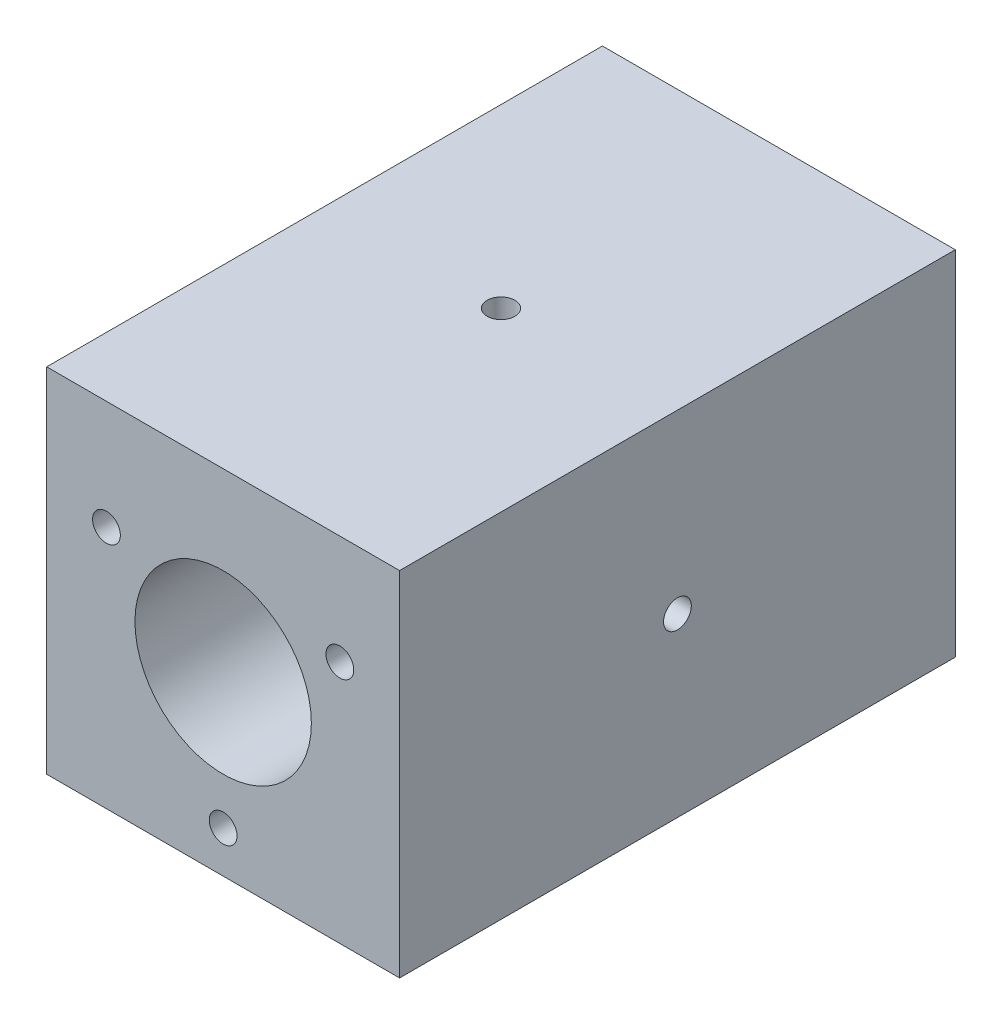
ISO-10303-21;
HEADER;
FILE_DESCRIPTION(('STEP AP214'),'2;1');
FILE_NAME('part.step','',(''),(''),'','','');
FILE_SCHEMA(('AUTOMOTIVE_DESIGN { 1 0 10303 214 1 1 1 1 }'));
ENDSEC;
DATA;
#1=APPLICATION_CONTEXT('core data for automotive mechanical design processes');
#2=APPLICATION_PROTOCOL_DEFINITION('international standard','automotive_design',2000,#1);
#3=PRODUCT_CONTEXT('',#1,'mechanical');
#4=PRODUCT('Part','Part','',(#3));
#5=PRODUCT_RELATED_PRODUCT_CATEGORY('part','',(#4));
#6=PRODUCT_DEFINITION_FORMATION('','',#4);
#7=PRODUCT_DEFINITION_CONTEXT('part definition',#1,'design');
#8=PRODUCT_DEFINITION('design','',#6,#7);
#9=PRODUCT_DEFINITION_SHAPE('','',#8);
#10=(LENGTH_UNIT() NAMED_UNIT(*) SI_UNIT(.MILLI.,.METRE.));
#11=(NAMED_UNIT(*) PLANE_ANGLE_UNIT() SI_UNIT($,.RADIAN.));
#12=(NAMED_UNIT(*) SI_UNIT($,.STERADIAN.) SOLID_ANGLE_UNIT());
#13=UNCERTAINTY_MEASURE_WITH_UNIT(LENGTH_MEASURE(1.E-05),#10,'distance_accuracy_value','');
#14=(GEOMETRIC_REPRESENTATION_CONTEXT(3) GLOBAL_UNCERTAINTY_ASSIGNED_CONTEXT((#13)) GLOBAL_UNIT_ASSIGNED_CONTEXT((#10,
#11,#12)) REPRESENTATION_CONTEXT('',''));
#15=CARTESIAN_POINT('',(0.,0.,0.));
#16=DIRECTION('',(0.,0.,1.));
#17=DIRECTION('',(1.,0.,0.));
#18=AXIS2_PLACEMENT_3D('',#15,#16,#17);
#19=CARTESIAN_POINT('',(0.,0.,25.));
#20=DIRECTION('',(0.,0.,-1.));
#21=DIRECTION('',(-1.,0.,0.));
#22=AXIS2_PLACEMENT_3D('',#19,#20,#21);
#23=PLANE('',#22);
#24=DIRECTION('',(0.,-1.,0.));
#25=VECTOR('',#24,1.);
#26=CARTESIAN_POINT('',(-15.875,15.875,25.));
#27=LINE('',#26,#25);
#28=CARTESIAN_POINT('',(-15.875,15.875,25.));
#29=VERTEX_POINT('',#28);
#30=CARTESIAN_POINT('',(-15.875,-15.875,25.));
#31=VERTEX_POINT('',#30);
#32=EDGE_CURVE('E106',#29,#31,#27,.T.);
#33=ORIENTED_EDGE('',*,*,#32,.T.);
#34=DIRECTION('',(1.,0.,0.));
#35=VECTOR('',#34,1.);
#36=CARTESIAN_POINT('',(15.875,-15.875,25.));
#37=LINE('',#36,#35);
#38=CARTESIAN_POINT('',(15.875,-15.875,25.));
#39=VERTEX_POINT('',#38);
#40=EDGE_CURVE('E101',#31,#39,#37,.T.);
#41=ORIENTED_EDGE('',*,*,#40,.T.);
#42=DIRECTION('',(0.,1.,0.));
#43=VECTOR('',#42,1.);
#44=CARTESIAN_POINT('',(15.875,15.875,25.));
#45=LINE('',#44,#43);
#46=CARTESIAN_POINT('',(15.875,15.875,25.));
#47=VERTEX_POINT('',#46);
#48=EDGE_CURVE('E104',#39,#47,#45,.T.);
#49=ORIENTED_EDGE('',*,*,#48,.T.);
#50=DIRECTION('',(-1.,0.,0.));
#51=VECTOR('',#50,1.);
#52=CARTESIAN_POINT('',(15.875,15.875,25.));
#53=LINE('',#52,#51);
#54=EDGE_CURVE('E71',#47,#29,#53,.T.);
#55=ORIENTED_EDGE('',*,*,#54,.T.);
#56=EDGE_LOOP('',(#33,#41,#49,#55));
#57=FACE_BOUND('',#56,.T.);
#58=CARTESIAN_POINT('',(0.,0.,25.));
#59=DIRECTION('',(0.,0.,1.));
#60=DIRECTION('',(1.,0.,0.));
#61=AXIS2_PLACEMENT_3D('',#58,#59,#60);
#62=CIRCLE('',#61,7.9375);
#63=CARTESIAN_POINT('',(7.93750000000001,0.,25.));
#64=VERTEX_POINT('',#63);
#65=EDGE_CURVE('E126',#64,#64,#62,.T.);
#66=ORIENTED_EDGE('',*,*,#65,.F.);
#67=EDGE_LOOP('',(#66));
#68=FACE_BOUND('',#67,.T.);
#69=CARTESIAN_POINT('',(-10.5,6.06217782649108,25.));
#70=DIRECTION('',(0.,0.,1.));
#71=DIRECTION('',(1.,0.,0.));
#72=AXIS2_PLACEMENT_3D('',#69,#70,#71);
#73=CIRCLE('',#72,1.25);
#74=CARTESIAN_POINT('',(-9.25,6.06217782649108,25.));
#75=VERTEX_POINT('',#74);
#76=EDGE_CURVE('E148',#75,#75,#73,.T.);
#77=ORIENTED_EDGE('',*,*,#76,.F.);
#78=EDGE_LOOP('',(#77));
#79=FACE_BOUND('',#78,.T.);
#80=CARTESIAN_POINT('',(10.5,6.06217782649108,25.));
#81=DIRECTION('',(0.,0.,1.));
#82=DIRECTION('',(1.,0.,0.));
#83=AXIS2_PLACEMENT_3D('',#80,#81,#82);
#84=CIRCLE('',#83,1.25);
#85=CARTESIAN_POINT('',(11.75,6.06217782649108,25.));
#86=VERTEX_POINT('',#85);
#87=EDGE_CURVE('E156',#86,#86,#84,.T.);
#88=ORIENTED_EDGE('',*,*,#87,.F.);
#89=EDGE_LOOP('',(#88));
#90=FACE_BOUND('',#89,.T.);
#91=CARTESIAN_POINT('',(0.,-12.1243556529821,25.));
#92=DIRECTION('',(0.,0.,1.));
#93=DIRECTION('',(1.,0.,0.));
#94=AXIS2_PLACEMENT_3D('',#91,#92,#93);
#95=CIRCLE('',#94,1.25);
#96=CARTESIAN_POINT('',(1.25,-12.1243556529821,25.));
#97=VERTEX_POINT('',#96);
#98=EDGE_CURVE('E164',#97,#97,#95,.T.);
#99=ORIENTED_EDGE('',*,*,#98,.F.);
#100=EDGE_LOOP('',(#99));
#101=FACE_BOUND('',#100,.T.);
#102=ADVANCED_FACE('F53',(#57,#68,#79,#90,#101),#23,.F.);
#103=CARTESIAN_POINT('',(0.,0.,-25.));
#104=DIRECTION('',(0.,0.,-1.));
#105=DIRECTION('',(-1.,0.,0.));
#106=AXIS2_PLACEMENT_3D('',#103,#104,#105);
#107=PLANE('',#106);
#108=CARTESIAN_POINT('',(10.5,6.06217782649108,-25.));
#109=DIRECTION('',(0.,0.,1.));
#110=DIRECTION('',(1.,0.,0.));
#111=AXIS2_PLACEMENT_3D('',#108,#109,#110);
#112=CIRCLE('',#111,1.25);
#113=CARTESIAN_POINT('',(11.75,6.06217782649108,-25.));
#114=VERTEX_POINT('',#113);
#115=EDGE_CURVE('E160',#114,#114,#112,.T.);
#116=ORIENTED_EDGE('',*,*,#115,.T.);
#117=EDGE_LOOP('',(#116));
#118=FACE_BOUND('',#117,.T.);
#119=CARTESIAN_POINT('',(0.,0.,-25.));
#120=DIRECTION('',(0.,0.,1.));
#121=DIRECTION('',(1.,0.,0.));
#122=AXIS2_PLACEMENT_3D('',#119,#120,#121);
#123=CIRCLE('',#122,7.9375);
#124=CARTESIAN_POINT('',(7.93750000000001,0.,-25.));
#125=VERTEX_POINT('',#124);
#126=EDGE_CURVE('E144',#125,#125,#123,.T.);
#127=ORIENTED_EDGE('',*,*,#126,.T.);
#128=EDGE_LOOP('',(#127));
#129=FACE_BOUND('',#128,.T.);
#130=DIRECTION('',(0.,-1.,0.));
#131=VECTOR('',#130,1.);
#132=CARTESIAN_POINT('',(-15.875,15.875,-25.));
#133=LINE('',#132,#131);
#134=CARTESIAN_POINT('',(-15.875,15.875,-25.));
#135=VERTEX_POINT('',#134);
#136=CARTESIAN_POINT('',(-15.875,-15.875,-25.));
#137=VERTEX_POINT('',#136);
#138=EDGE_CURVE('E122',#135,#137,#133,.T.);
#139=ORIENTED_EDGE('',*,*,#138,.F.);
#140=DIRECTION('',(-1.,0.,0.));
#141=VECTOR('',#140,1.);
#142=CARTESIAN_POINT('',(15.875,15.875,-25.));
#143=LINE('',#142,#141);
#144=CARTESIAN_POINT('',(15.875,15.875,-25.));
#145=VERTEX_POINT('',#144);
#146=EDGE_CURVE('E94',#145,#135,#143,.T.);
#147=ORIENTED_EDGE('',*,*,#146,.F.);
#148=DIRECTION('',(0.,1.,0.));
#149=VECTOR('',#148,1.);
#150=CARTESIAN_POINT('',(15.875,15.875,-25.));
#151=LINE('',#150,#149);
#152=CARTESIAN_POINT('',(15.875,-15.875,-25.));
#153=VERTEX_POINT('',#152);
#154=EDGE_CURVE('E88',#153,#145,#151,.T.);
#155=ORIENTED_EDGE('',*,*,#154,.F.);
#156=DIRECTION('',(1.,0.,0.));
#157=VECTOR('',#156,1.);
#158=CARTESIAN_POINT('',(15.875,-15.875,-25.));
#159=LINE('',#158,#157);
#160=EDGE_CURVE('E111',#137,#153,#159,.T.);
#161=ORIENTED_EDGE('',*,*,#160,.F.);
#162=EDGE_LOOP('',(#139,#147,#155,#161));
#163=FACE_BOUND('',#162,.T.);
#164=CARTESIAN_POINT('',(-10.5,6.06217782649108,-25.));
#165=DIRECTION('',(0.,0.,1.));
#166=DIRECTION('',(1.,0.,0.));
#167=AXIS2_PLACEMENT_3D('',#164,#165,#166);
#168=CIRCLE('',#167,1.25);
#169=CARTESIAN_POINT('',(-9.25,6.06217782649108,-25.));
#170=VERTEX_POINT('',#169);
#171=EDGE_CURVE('E152',#170,#170,#168,.T.);
#172=ORIENTED_EDGE('',*,*,#171,.T.);
#173=EDGE_LOOP('',(#172));
#174=FACE_BOUND('',#173,.T.);
#175=CARTESIAN_POINT('',(0.,-12.1243556529821,-25.));
#176=DIRECTION('',(0.,0.,1.));
#177=DIRECTION('',(1.,0.,0.));
#178=AXIS2_PLACEMENT_3D('',#175,#176,#177);
#179=CIRCLE('',#178,1.25);
#180=CARTESIAN_POINT('',(1.25,-12.1243556529821,-25.));
#181=VERTEX_POINT('',#180);
#182=EDGE_CURVE('E168',#181,#181,#179,.T.);
#183=ORIENTED_EDGE('',*,*,#182,.T.);
#184=EDGE_LOOP('',(#183));
#185=FACE_BOUND('',#184,.T.);
#186=ADVANCED_FACE('F139',(#118,#129,#163,#174,#185),#107,.T.);
#187=CARTESIAN_POINT('',(-15.875,15.875,25.));
#188=DIRECTION('',(1.,0.,0.));
#189=DIRECTION('',(0.,1.,0.));
#190=AXIS2_PLACEMENT_3D('',#187,#188,#189);
#191=PLANE('',#190);
#192=ORIENTED_EDGE('',*,*,#138,.T.);
#193=DIRECTION('',(0.,0.,-1.));
#194=VECTOR('',#193,1.);
#195=CARTESIAN_POINT('',(-15.875,-15.875,25.));
#196=LINE('',#195,#194);
#197=EDGE_CURVE('E11',#31,#137,#196,.T.);
#198=ORIENTED_EDGE('',*,*,#197,.F.);
#199=ORIENTED_EDGE('',*,*,#32,.F.);
#200=DIRECTION('',(0.,0.,-1.));
#201=VECTOR('',#200,1.);
#202=CARTESIAN_POINT('',(-15.875,15.875,25.));
#203=LINE('',#202,#201);
#204=EDGE_CURVE('E118',#29,#135,#203,.T.);
#205=ORIENTED_EDGE('',*,*,#204,.T.);
#206=EDGE_LOOP('',(#192,#198,#199,#205));
#207=FACE_BOUND('',#206,.T.);
#208=ADVANCED_FACE('F55',(#207),#191,.F.);
#209=CARTESIAN_POINT('',(15.875,-15.875,25.));
#210=DIRECTION('',(0.,1.,0.));
#211=DIRECTION('',(-1.,0.,0.));
#212=AXIS2_PLACEMENT_3D('',#209,#210,#211);
#213=PLANE('',#212);
#214=ORIENTED_EDGE('',*,*,#160,.T.);
#215=DIRECTION('',(0.,0.,-1.));
#216=VECTOR('',#215,1.);
#217=CARTESIAN_POINT('',(15.875,-15.875,25.));
#218=LINE('',#217,#216);
#219=EDGE_CURVE('E63',#39,#153,#218,.T.);
#220=ORIENTED_EDGE('',*,*,#219,.F.);
#221=ORIENTED_EDGE('',*,*,#40,.F.);
#222=ORIENTED_EDGE('',*,*,#197,.T.);
#223=EDGE_LOOP('',(#214,#220,#221,#222));
#224=FACE_BOUND('',#223,.T.);
#225=ADVANCED_FACE('F110',(#224),#213,.F.);
#226=CARTESIAN_POINT('',(15.875,15.875,25.));
#227=DIRECTION('',(-1.,0.,0.));
#228=DIRECTION('',(0.,-1.,0.));
#229=AXIS2_PLACEMENT_3D('',#226,#227,#228);
#230=PLANE('',#229);
#231=CARTESIAN_POINT('',(15.875,0.,0.));
#232=DIRECTION('',(1.,0.,0.));
#233=DIRECTION('',(0.,0.,-1.));
#234=AXIS2_PLACEMENT_3D('',#231,#232,#233);
#235=CIRCLE('',#234,1.24999999999999);
#236=CARTESIAN_POINT('',(15.875,0.,-1.24999999999999));
#237=VERTEX_POINT('',#236);
#238=EDGE_CURVE('E205',#237,#237,#235,.T.);
#239=ORIENTED_EDGE('',*,*,#238,.F.);
#240=EDGE_LOOP('',(#239));
#241=FACE_BOUND('',#240,.T.);
#242=ORIENTED_EDGE('',*,*,#154,.T.);
#243=DIRECTION('',(0.,0.,-1.));
#244=VECTOR('',#243,1.);
#245=CARTESIAN_POINT('',(15.875,15.875,25.));
#246=LINE('',#245,#244);
#247=EDGE_CURVE('E113',#47,#145,#246,.T.);
#248=ORIENTED_EDGE('',*,*,#247,.F.);
#249=ORIENTED_EDGE('',*,*,#48,.F.);
#250=ORIENTED_EDGE('',*,*,#219,.T.);
#251=EDGE_LOOP('',(#242,#248,#249,#250));
#252=FACE_BOUND('',#251,.T.);
#253=ADVANCED_FACE('F114',(#241,#252),#230,.F.);
#254=CARTESIAN_POINT('',(15.875,15.875,25.));
#255=DIRECTION('',(0.,-1.,0.));
#256=DIRECTION('',(1.,0.,0.));
#257=AXIS2_PLACEMENT_3D('',#254,#255,#256);
#258=PLANE('',#257);
#259=CARTESIAN_POINT('',(0.,15.875,0.));
#260=DIRECTION('',(0.,1.,0.));
#261=DIRECTION('',(0.,0.,1.));
#262=AXIS2_PLACEMENT_3D('',#259,#260,#261);
#263=CIRCLE('',#262,1.25);
#264=CARTESIAN_POINT('',(0.,15.875,1.25));
#265=VERTEX_POINT('',#264);
#266=EDGE_CURVE('E184',#265,#265,#263,.T.);
#267=ORIENTED_EDGE('',*,*,#266,.F.);
#268=EDGE_LOOP('',(#267));
#269=FACE_BOUND('',#268,.T.);
#270=ORIENTED_EDGE('',*,*,#146,.T.);
#271=ORIENTED_EDGE('',*,*,#204,.F.);
#272=ORIENTED_EDGE('',*,*,#54,.F.);
#273=ORIENTED_EDGE('',*,*,#247,.T.);
#274=EDGE_LOOP('',(#270,#271,#272,#273));
#275=FACE_BOUND('',#274,.T.);
#276=ADVANCED_FACE('F136',(#269,#275),#258,.F.);
#277=CARTESIAN_POINT('',(0.,0.,25.));
#278=DIRECTION('',(0.,0.,-1.));
#279=DIRECTION('',(-1.,0.,0.));
#280=AXIS2_PLACEMENT_3D('',#277,#278,#279);
#281=CYLINDRICAL_SURFACE('',#280,7.9375);
#282=CARTESIAN_POINT('',(7.93750000000001,0.,-1.24999999999999));
#283=CARTESIAN_POINT('',(7.93749884526427,-0.0697504150927674,-1.24999715690116));
#284=CARTESIAN_POINT('',(7.93657099739005,-0.139540255432463,-1.24414214042688));
#285=CARTESIAN_POINT('',(7.9329589474276,-0.277166301084599,-1.22088436228467));
#286=CARTESIAN_POINT('',(7.93027307667876,-0.345000586315197,-1.20347062922113));
#287=CARTESIAN_POINT('',(7.92344656155909,-0.476704125127085,-1.15763109928079));
#288=CARTESIAN_POINT('',(7.91930705658603,-0.540576438204386,-1.12921392541241));
#289=CARTESIAN_POINT('',(7.91002969799435,-0.662637137536172,-1.06219591551795));
#290=CARTESIAN_POINT('',(7.90489197232907,-0.720826250836256,-1.02359638445419));
#291=CARTESIAN_POINT('',(7.89413945906247,-0.830376856604447,-0.936956904689493));
#292=CARTESIAN_POINT('',(7.88852131381747,-0.881682542018239,-0.888846800414665));
#293=CARTESIAN_POINT('',(7.8774671865371,-0.975528165248917,-0.784702836989211));
#294=CARTESIAN_POINT('',(7.87203121543035,-1.01806757796236,-0.728668503512718));
#295=CARTESIAN_POINT('',(7.86192437477424,-1.09339319291298,-0.609888015013124));
#296=CARTESIAN_POINT('',(7.85725784468265,-1.12612487509418,-0.547106884300299));
#297=CARTESIAN_POINT('',(7.84926443015854,-1.18055738222958,-0.416852120969527));
#298=CARTESIAN_POINT('',(7.84593746514309,-1.20225887073718,-0.349378770903369));
#299=CARTESIAN_POINT('',(7.84103307296807,-1.23384053416383,-0.21224390385941));
#300=CARTESIAN_POINT('',(7.83944146000214,-1.24381661283797,-0.142604989907457));
#301=CARTESIAN_POINT('',(7.83814498405106,-1.25196148267928,-0.00262482112364988));
#302=CARTESIAN_POINT('',(7.83844000178568,-1.25013102030242,0.0677163890255272));
#303=CARTESIAN_POINT('',(7.8408704904039,-1.23479302959007,0.206423844941958));
#304=CARTESIAN_POINT('',(7.84298906258341,-1.22139271446387,0.274802285082373));
#305=CARTESIAN_POINT('',(7.84880152933236,-1.18346341997124,0.40832798997412));
#306=CARTESIAN_POINT('',(7.85249547261565,-1.15893409647064,0.473475154737981));
#307=CARTESIAN_POINT('',(7.86106095443948,-1.09933280333051,0.599012934343867));
#308=CARTESIAN_POINT('',(7.86593750418005,-1.06421581101909,0.659381817927734));
#309=CARTESIAN_POINT('',(7.87631517667283,-0.984468043254831,0.773410723001881));
#310=CARTESIAN_POINT('',(7.88181634452122,-0.939836580671971,0.82707025950237));
#311=CARTESIAN_POINT('',(7.89289789663712,-0.841740186655551,0.926778309363158));
#312=CARTESIAN_POINT('',(7.89847848488607,-0.78818315923662,0.972736240953957));
#313=CARTESIAN_POINT('',(7.90903379069807,-0.674068754426928,1.05502591003618));
#314=CARTESIAN_POINT('',(7.91400850509368,-0.613511340442199,1.09135759720391));
#315=CARTESIAN_POINT('',(7.92279753342772,-0.48703374878246,1.15336967092633));
#316=CARTESIAN_POINT('',(7.92661103736327,-0.421109868165423,1.17904262699487));
#317=CARTESIAN_POINT('',(7.9326413197818,-0.285812810610449,1.21892741584569));
#318=CARTESIAN_POINT('',(7.93485821736243,-0.216439891363735,1.23314010350756));
#319=CARTESIAN_POINT('',(7.93742962433742,-0.0769953220393042,1.24957943781758));
#320=CARTESIAN_POINT('',(7.93780347008134,-0.00693868750640217,1.25193053627866));
#321=CARTESIAN_POINT('',(7.93669942846577,0.132567999528165,1.24491092364233));
#322=CARTESIAN_POINT('',(7.93522160447956,0.202018072707433,1.2355406137093));
#323=CARTESIAN_POINT('',(7.930592235018,0.337959990056605,1.20544767489133));
#324=CARTESIAN_POINT('',(7.9274496947657,0.404465684077796,1.18478610682746));
#325=CARTESIAN_POINT('',(7.91984198415274,0.533069085734835,1.13276185501904));
#326=CARTESIAN_POINT('',(7.91537674627077,0.595166568138833,1.10139862496167));
#327=CARTESIAN_POINT('',(7.90557144085229,0.713735168663208,1.02857239567006));
#328=CARTESIAN_POINT('',(7.90022469153128,0.770157557562097,0.987030976775549));
#329=CARTESIAN_POINT('',(7.88927112786205,0.875274535241822,0.89513618584503));
#330=CARTESIAN_POINT('',(7.88366429678058,0.923968625902502,0.844782246245802));
#331=CARTESIAN_POINT('',(7.87276064936421,1.01270330904595,0.736135910684062));
#332=CARTESIAN_POINT('',(7.86746715904295,1.05266018369139,0.677774754492342));
#333=CARTESIAN_POINT('',(7.85784984125407,1.12220308672281,0.555095780085868));
#334=CARTESIAN_POINT('',(7.85352598553827,1.15178941724605,0.490778135477524));
#335=CARTESIAN_POINT('',(7.84636196860052,1.19962360576266,0.358254767835383));
#336=CARTESIAN_POINT('',(7.84351618551746,1.21791447707634,0.290064887878343));
#337=CARTESIAN_POINT('',(7.83961594231868,1.24277479070219,0.151532584450695));
#338=CARTESIAN_POINT('',(7.83856134465337,1.24934513306497,0.0811903266889055));
#339=CARTESIAN_POINT('',(7.838368363452,1.25055485297194,-0.0588148871490922));
#340=CARTESIAN_POINT('',(7.83920882920989,1.24532592110439,-0.128476711630321));
#341=CARTESIAN_POINT('',(7.8426651396402,1.22336884225765,-0.265916702805816));
#342=CARTESIAN_POINT('',(7.84528098025903,1.20664072153373,-0.333694873800527));
#343=CARTESIAN_POINT('',(7.85198562458484,1.16220839654518,-0.465400776867293));
#344=CARTESIAN_POINT('',(7.85607306729066,1.13451433170473,-0.529332003205456));
#345=CARTESIAN_POINT('',(7.86526186497778,1.06894952177457,-0.651662089270439));
#346=CARTESIAN_POINT('',(7.87036326131223,1.03107836159943,-0.710060723212201));
#347=CARTESIAN_POINT('',(7.88107276171686,0.94575959555236,-0.820335379737902));
#348=CARTESIAN_POINT('',(7.8866856639543,0.89821472887681,-0.872135695944193));
#349=CARTESIAN_POINT('',(7.89774647155334,0.79510365730607,-0.967068708971834));
#350=CARTESIAN_POINT('',(7.90319433839691,0.739535597042464,-1.01019939540202));
#351=CARTESIAN_POINT('',(7.91334950238607,0.621554416670283,-1.08680660682811));
#352=CARTESIAN_POINT('',(7.91805207548325,0.559101579903618,-1.12022258787847));
#353=CARTESIAN_POINT('',(7.92614067856452,0.429423082762671,-1.17603937605101));
#354=CARTESIAN_POINT('',(7.92952804861362,0.362202363456729,-1.19845140133676));
#355=CARTESIAN_POINT('',(7.93384613614359,0.24558107158262,-1.22663515615439));
#356=CARTESIAN_POINT('',(7.93520917367193,0.196894322586625,-1.23538330462386));
#357=CARTESIAN_POINT('',(7.93703650816938,0.0988116383781604,-1.2470666917814));
#358=CARTESIAN_POINT('',(7.93750081808962,0.0494157133956311,-1.25000201423542));
#359=CARTESIAN_POINT('',(7.93750000000001,0.,-1.24999999999999));
#360=B_SPLINE_CURVE_WITH_KNOTS('',3,(#282,#283,#284,#285,#286,#287,#288,#289,#290,#291,#292,
#293,#294,#295,#296,#297,#298,#299,#300,#301,#302,#303,#304,#305,#306,#307,#308,#309,#310,#311,
#312,#313,#314,#315,#316,#317,#318,#319,#320,#321,#322,#323,#324,#325,#326,#327,#328,#329,#330,
#331,#332,#333,#334,#335,#336,#337,#338,#339,#340,#341,#342,#343,#344,#345,#346,#347,#348,#349,
#350,#351,#352,#353,#354,#355,#356,#357,#358,#359),.UNSPECIFIED.,.T.,.F.,(4,2,2,2,2,2,2,2,2,2,2,
2,2,2,2,2,2,2,2,2,2,2,2,2,2,2,2,2,2,2,2,2,2,2,2,2,2,2,4),(0.,0.209070649752808,
0.418340031189464,0.627445746423542,0.836524675854105,1.0472076740045,1.25790328848955,
1.46974928780809,1.68158254140507,1.89167085055406,2.10174587722381,2.30989486403974,
2.51805028773291,2.72710365769201,2.93617213049288,3.14754909867532,3.35892717186415,
3.57045235592169,3.78196175978216,3.99124732286284,4.20052572335571,4.40868342979393,
4.61685176413649,4.82667739427569,5.03651654304005,5.24828586448026,5.46004901568289,
5.67100071439108,5.88193621285946,6.09052913864055,6.29912158815779,6.50752161585206,
6.71593014468972,6.92654793892305,7.13721451689053,7.34916716807057,7.56090328964163,
7.70902461878047,7.85714381339575),.UNSPECIFIED.);
#361=CARTESIAN_POINT('',(7.93750000000001,0.,-1.24999999999999));
#362=VERTEX_POINT('',#361);
#363=EDGE_CURVE('E198',#362,#362,#360,.T.);
#364=ORIENTED_EDGE('',*,*,#363,.F.);
#365=EDGE_LOOP('',(#364));
#366=FACE_BOUND('',#365,.T.);
#367=CARTESIAN_POINT('',(0.,7.9375,1.25));
#368=CARTESIAN_POINT('',(-0.0697504150927729,7.93749884526426,1.24999715690116));
#369=CARTESIAN_POINT('',(-0.139540255432468,7.93657099739004,1.24414214042688));
#370=CARTESIAN_POINT('',(-0.277166301084606,7.93295894742759,1.22088436228468));
#371=CARTESIAN_POINT('',(-0.345000586315204,7.93027307667875,1.20347062922113));
#372=CARTESIAN_POINT('',(-0.476704125127092,7.92344656155908,1.15763109928079));
#373=CARTESIAN_POINT('',(-0.540576438204393,7.91930705658602,1.12921392541241));
#374=CARTESIAN_POINT('',(-0.66263713753618,7.91002969799434,1.06219591551796));
#375=CARTESIAN_POINT('',(-0.720826250836264,7.90489197232906,1.02359638445419));
#376=CARTESIAN_POINT('',(-0.830376856604455,7.89413945906246,0.936956904689497));
#377=CARTESIAN_POINT('',(-0.881682542018248,7.88852131381746,0.888846800414669));
#378=CARTESIAN_POINT('',(-0.975528165248926,7.87746718653709,0.784702836989215));
#379=CARTESIAN_POINT('',(-1.01806757796237,7.87203121543034,0.728668503512721));
#380=CARTESIAN_POINT('',(-1.09339319291299,7.86192437477423,0.609888015013127));
#381=CARTESIAN_POINT('',(-1.12612487509419,7.85725784468263,0.547106884300301));
#382=CARTESIAN_POINT('',(-1.18055738222959,7.84926443015852,0.416852120969529));
#383=CARTESIAN_POINT('',(-1.20225887073719,7.84593746514307,0.349378770903371));
#384=CARTESIAN_POINT('',(-1.23384053416384,7.84103307296805,0.21224390385941));
#385=CARTESIAN_POINT('',(-1.24381661283798,7.83944146000212,0.142604989907458));
#386=CARTESIAN_POINT('',(-1.25196148267929,7.83814498405104,0.0026248211236497));
#387=CARTESIAN_POINT('',(-1.25013102030243,7.83844000178567,-0.0677163890255276));
#388=CARTESIAN_POINT('',(-1.23479302959008,7.84087049040389,-0.206423844941959));
#389=CARTESIAN_POINT('',(-1.22139271446388,7.84298906258339,-0.274802285082375));
#390=CARTESIAN_POINT('',(-1.18346341997125,7.84880152933235,-0.408327989974122));
#391=CARTESIAN_POINT('',(-1.15893409647065,7.85249547261564,-0.473475154737983));
#392=CARTESIAN_POINT('',(-1.09933280333052,7.86106095443947,-0.599012934343869));
#393=CARTESIAN_POINT('',(-1.0642158110191,7.86593750418003,-0.659381817927736));
#394=CARTESIAN_POINT('',(-0.98446804325484,7.87631517667281,-0.773410723001884));
#395=CARTESIAN_POINT('',(-0.93983658067198,7.8818163445212,-0.827070259502373));
#396=CARTESIAN_POINT('',(-0.84174018665556,7.89289789663711,-0.926778309363161));
#397=CARTESIAN_POINT('',(-0.788183159236628,7.89847848488606,-0.97273624095396));
#398=CARTESIAN_POINT('',(-0.674068754426936,7.90903379069806,-1.05502591003619));
#399=CARTESIAN_POINT('',(-0.613511340442207,7.91400850509367,-1.09135759720391));
#400=CARTESIAN_POINT('',(-0.487033748782468,7.92279753342771,-1.15336967092634));
#401=CARTESIAN_POINT('',(-0.42110986816543,7.92661103736326,-1.17904262699488));
#402=CARTESIAN_POINT('',(-0.285812810610455,7.93264131978179,-1.2189274158457));
#403=CARTESIAN_POINT('',(-0.216439891363741,7.93485821736242,-1.23314010350756));
#404=CARTESIAN_POINT('',(-0.07699532203931,7.93742962433741,-1.24957943781759));
#405=CARTESIAN_POINT('',(-0.00693868750640761,7.93780347008132,-1.25193053627867));
#406=CARTESIAN_POINT('',(0.13256799952816,7.93669942846577,-1.24491092364233));
#407=CARTESIAN_POINT('',(0.202018072707429,7.93522160447955,-1.2355406137093));
#408=CARTESIAN_POINT('',(0.337959990056601,7.93059223501799,-1.20544767489133));
#409=CARTESIAN_POINT('',(0.404465684077792,7.92744969476569,-1.18478610682746));
#410=CARTESIAN_POINT('',(0.533069085734832,7.91984198415273,-1.13276185501904));
#411=CARTESIAN_POINT('',(0.59516656813883,7.91537674627076,-1.10139862496168));
#412=CARTESIAN_POINT('',(0.713735168663206,7.90557144085228,-1.02857239567006));
#413=CARTESIAN_POINT('',(0.770157557562095,7.90022469153127,-0.987030976775553));
#414=CARTESIAN_POINT('',(0.87527453524182,7.88927112786204,-0.895136185845034));
#415=CARTESIAN_POINT('',(0.923968625902501,7.88366429678057,-0.844782246245806));
#416=CARTESIAN_POINT('',(1.01270330904595,7.8727606493642,-0.736135910684065));
#417=CARTESIAN_POINT('',(1.05266018369139,7.86746715904294,-0.677774754492345));
#418=CARTESIAN_POINT('',(1.12220308672281,7.85784984125406,-0.555095780085871));
#419=CARTESIAN_POINT('',(1.15178941724604,7.85352598553826,-0.490778135477527));
#420=CARTESIAN_POINT('',(1.19962360576266,7.84636196860052,-0.358254767835385));
#421=CARTESIAN_POINT('',(1.21791447707634,7.84351618551746,-0.290064887878345));
#422=CARTESIAN_POINT('',(1.24277479070219,7.83961594231868,-0.151532584450696));
#423=CARTESIAN_POINT('',(1.24934513306497,7.83856134465336,-0.081190326688906));
#424=CARTESIAN_POINT('',(1.25055485297194,7.83836836345199,0.0588148871490924));
#425=CARTESIAN_POINT('',(1.24532592110439,7.83920882920988,0.128476711630321));
#426=CARTESIAN_POINT('',(1.22336884225765,7.84266513964019,0.265916702805817));
#427=CARTESIAN_POINT('',(1.20664072153373,7.84528098025902,0.333694873800528));
#428=CARTESIAN_POINT('',(1.16220839654518,7.85198562458483,0.465400776867295));
#429=CARTESIAN_POINT('',(1.13451433170473,7.85607306729065,0.529332003205459));
#430=CARTESIAN_POINT('',(1.06894952177457,7.86526186497777,0.651662089270441));
#431=CARTESIAN_POINT('',(1.03107836159943,7.87036326131223,0.710060723212204));
#432=CARTESIAN_POINT('',(0.945759595552359,7.88107276171685,0.820335379737906));
#433=CARTESIAN_POINT('',(0.898214728876809,7.88668566395429,0.872135695944197));
#434=CARTESIAN_POINT('',(0.795103657306068,7.89774647155333,0.967068708971838));
#435=CARTESIAN_POINT('',(0.739535597042462,7.90319433839689,1.01019939540203));
#436=CARTESIAN_POINT('',(0.62155441667028,7.91334950238606,1.08680660682812));
#437=CARTESIAN_POINT('',(0.559101579903616,7.91805207548324,1.12022258787847));
#438=CARTESIAN_POINT('',(0.429423082762668,7.92614067856451,1.17603937605102));
#439=CARTESIAN_POINT('',(0.362202363456725,7.92952804861361,1.19845140133677));
#440=CARTESIAN_POINT('',(0.245581071582616,7.93384613614358,1.22663515615439));
#441=CARTESIAN_POINT('',(0.196894322586621,7.93520917367192,1.23538330462386));
#442=CARTESIAN_POINT('',(0.0988116383781559,7.93703650816937,1.2470666917814));
#443=CARTESIAN_POINT('',(0.0494157133956262,7.93750081808961,1.25000201423542));
#444=CARTESIAN_POINT('',(0.,7.9375,1.25));
#445=B_SPLINE_CURVE_WITH_KNOTS('',3,(#367,#368,#369,#370,#371,#372,#373,#374,#375,#376,#377,
#378,#379,#380,#381,#382,#383,#384,#385,#386,#387,#388,#389,#390,#391,#392,#393,#394,#395,#396,
#397,#398,#399,#400,#401,#402,#403,#404,#405,#406,#407,#408,#409,#410,#411,#412,#413,#414,#415,
#416,#417,#418,#419,#420,#421,#422,#423,#424,#425,#426,#427,#428,#429,#430,#431,#432,#433,#434,
#435,#436,#437,#438,#439,#440,#441,#442,#443,#444),.UNSPECIFIED.,.T.,.F.,(4,2,2,2,2,2,2,2,2,2,2,
2,2,2,2,2,2,2,2,2,2,2,2,2,2,2,2,2,2,2,2,2,2,2,2,2,2,2,4),(0.,0.209070649752809,
0.418340031189465,0.627445746423545,0.836524675854109,1.04720767400451,1.25790328848956,
1.4697492878081,1.68158254140508,1.89167085055407,2.10174587722382,2.30989486403976,
2.51805028773292,2.72710365769202,2.93617213049289,3.14754909867534,3.35892717186417,
3.57045235592171,3.78196175978217,3.99124732286286,4.20052572335573,4.40868342979395,
4.61685176413651,4.82667739427572,5.03651654304007,5.24828586448028,5.46004901568291,
5.6710007143911,5.88193621285949,6.09052913864058,6.29912158815782,6.50752161585209,
6.71593014468975,6.92654793892308,7.13721451689057,7.34916716807061,7.56090328964167,
7.7090246187805,7.85714381339579),.UNSPECIFIED.);
#446=CARTESIAN_POINT('',(0.,7.9375,1.25));
#447=VERTEX_POINT('',#446);
#448=EDGE_CURVE('E172',#447,#447,#445,.T.);
#449=ORIENTED_EDGE('',*,*,#448,.F.);
#450=EDGE_LOOP('',(#449));
#451=FACE_BOUND('',#450,.T.);
#452=ORIENTED_EDGE('',*,*,#65,.T.);
#453=EDGE_LOOP('',(#452));
#454=FACE_BOUND('',#453,.T.);
#455=ORIENTED_EDGE('',*,*,#126,.F.);
#456=EDGE_LOOP('',(#455));
#457=FACE_BOUND('',#456,.T.);
#458=ADVANCED_FACE('F218',(#366,#451,#454,#457),#281,.F.);
#459=CARTESIAN_POINT('',(-10.5,6.06217782649108,25.));
#460=DIRECTION('',(0.,0.,-1.));
#461=DIRECTION('',(-1.,0.,0.));
#462=AXIS2_PLACEMENT_3D('',#459,#460,#461);
#463=CYLINDRICAL_SURFACE('',#462,1.25);
#464=ORIENTED_EDGE('',*,*,#76,.T.);
#465=EDGE_LOOP('',(#464));
#466=FACE_BOUND('',#465,.T.);
#467=ORIENTED_EDGE('',*,*,#171,.F.);
#468=EDGE_LOOP('',(#467));
#469=FACE_BOUND('',#468,.T.);
#470=ADVANCED_FACE('F232',(#466,#469),#463,.F.);
#471=CARTESIAN_POINT('',(10.5,6.06217782649108,25.));
#472=DIRECTION('',(0.,0.,-1.));
#473=DIRECTION('',(-1.,0.,0.));
#474=AXIS2_PLACEMENT_3D('',#471,#472,#473);
#475=CYLINDRICAL_SURFACE('',#474,1.25);
#476=ORIENTED_EDGE('',*,*,#87,.T.);
#477=EDGE_LOOP('',(#476));
#478=FACE_BOUND('',#477,.T.);
#479=ORIENTED_EDGE('',*,*,#115,.F.);
#480=EDGE_LOOP('',(#479));
#481=FACE_BOUND('',#480,.T.);
#482=ADVANCED_FACE('F236',(#478,#481),#475,.F.);
#483=CARTESIAN_POINT('',(0.,-12.1243556529821,25.));
#484=DIRECTION('',(0.,0.,-1.));
#485=DIRECTION('',(-1.,0.,0.));
#486=AXIS2_PLACEMENT_3D('',#483,#484,#485);
#487=CYLINDRICAL_SURFACE('',#486,1.25);
#488=ORIENTED_EDGE('',*,*,#98,.T.);
#489=EDGE_LOOP('',(#488));
#490=FACE_BOUND('',#489,.T.);
#491=ORIENTED_EDGE('',*,*,#182,.F.);
#492=EDGE_LOOP('',(#491));
#493=FACE_BOUND('',#492,.T.);
#494=ADVANCED_FACE('F193',(#490,#493),#487,.F.);
#495=CARTESIAN_POINT('',(0.,15.875,0.));
#496=DIRECTION('',(0.,1.,0.));
#497=DIRECTION('',(0.,0.,1.));
#498=AXIS2_PLACEMENT_3D('',#495,#496,#497);
#499=CYLINDRICAL_SURFACE('',#498,1.25);
#500=ORIENTED_EDGE('',*,*,#266,.T.);
#501=EDGE_LOOP('',(#500));
#502=FACE_BOUND('',#501,.T.);
#503=ORIENTED_EDGE('',*,*,#448,.T.);
#504=EDGE_LOOP('',(#503));
#505=FACE_BOUND('',#504,.T.);
#506=ADVANCED_FACE('F188',(#502,#505),#499,.F.);
#507=CARTESIAN_POINT('',(15.875,0.,0.));
#508=DIRECTION('',(1.,0.,0.));
#509=DIRECTION('',(0.,0.,-1.));
#510=AXIS2_PLACEMENT_3D('',#507,#508,#509);
#511=CYLINDRICAL_SURFACE('',#510,1.24999999999999);
#512=ORIENTED_EDGE('',*,*,#238,.T.);
#513=EDGE_LOOP('',(#512));
#514=FACE_BOUND('',#513,.T.);
#515=ORIENTED_EDGE('',*,*,#363,.T.);
#516=EDGE_LOOP('',(#515));
#517=FACE_BOUND('',#516,.T.);
#518=ADVANCED_FACE('F192',(#514,#517),#511,.F.);
#519=CLOSED_SHELL('',(#102,#186,#208,#225,#253,#276,#458,#470,#482,#494,#506,#518));
#520=MANIFOLD_SOLID_BREP('B2',#519);
#521=ADVANCED_BREP_SHAPE_REPRESENTATION('',(#18,#520),#14);
#522=SHAPE_DEFINITION_REPRESENTATION(#9,#521);
ENDSEC;
END-ISO-10303-21;
